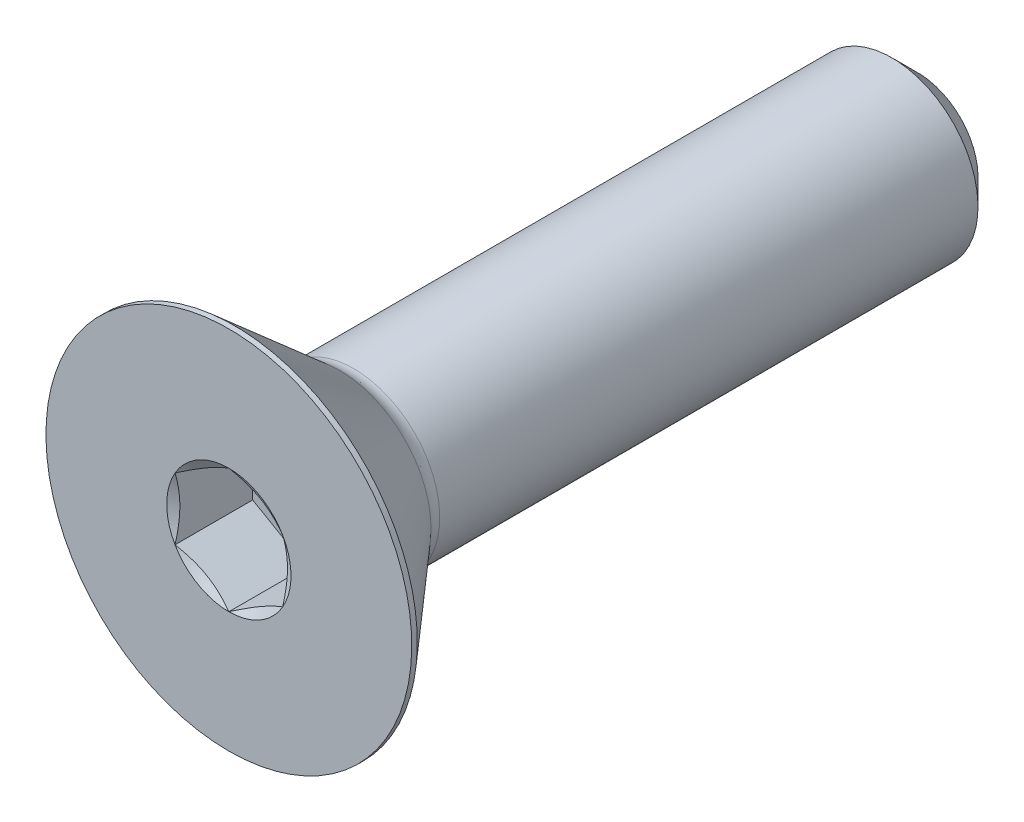
ISO-10303-21;
HEADER;
FILE_DESCRIPTION(('STEP AP214'),'2;1');
FILE_NAME('part.step','',(''),(''),'','','');
FILE_SCHEMA(('AUTOMOTIVE_DESIGN { 1 0 10303 214 1 1 1 1 }'));
ENDSEC;
DATA;
#1=APPLICATION_CONTEXT('core data for automotive mechanical design processes');
#2=APPLICATION_PROTOCOL_DEFINITION('international standard','automotive_design',2000,#1);
#3=PRODUCT_CONTEXT('',#1,'mechanical');
#4=PRODUCT('Part','Part','',(#3));
#5=PRODUCT_RELATED_PRODUCT_CATEGORY('part','',(#4));
#6=PRODUCT_DEFINITION_FORMATION('','',#4);
#7=PRODUCT_DEFINITION_CONTEXT('part definition',#1,'design');
#8=PRODUCT_DEFINITION('design','',#6,#7);
#9=PRODUCT_DEFINITION_SHAPE('','',#8);
#10=(LENGTH_UNIT() NAMED_UNIT(*) SI_UNIT(.MILLI.,.METRE.));
#11=(NAMED_UNIT(*) PLANE_ANGLE_UNIT() SI_UNIT($,.RADIAN.));
#12=(NAMED_UNIT(*) SI_UNIT($,.STERADIAN.) SOLID_ANGLE_UNIT());
#13=UNCERTAINTY_MEASURE_WITH_UNIT(LENGTH_MEASURE(1.E-05),#10,'distance_accuracy_value','');
#14=(GEOMETRIC_REPRESENTATION_CONTEXT(3) GLOBAL_UNCERTAINTY_ASSIGNED_CONTEXT((#13)) GLOBAL_UNIT_ASSIGNED_CONTEXT((#10,
#11,#12)) REPRESENTATION_CONTEXT('',''));
#15=CARTESIAN_POINT('',(0.,0.,0.));
#16=DIRECTION('',(0.,0.,1.));
#17=DIRECTION('',(1.,0.,0.));
#18=AXIS2_PLACEMENT_3D('',#15,#16,#17);
#19=CARTESIAN_POINT('',(0.,0.,-25.4));
#20=DIRECTION('',(0.,0.,-1.));
#21=DIRECTION('',(0.,1.,0.));
#22=AXIS2_PLACEMENT_3D('',#19,#20,#21);
#23=CYLINDRICAL_SURFACE('',#22,3.175);
#24=CARTESIAN_POINT('',(0.,0.,-24.4475));
#25=DIRECTION('',(0.,0.,-1.));
#26=DIRECTION('',(0.,1.,0.));
#27=AXIS2_PLACEMENT_3D('',#24,#25,#26);
#28=CIRCLE('',#27,3.175);
#29=CARTESIAN_POINT('',(0.,-3.175,-24.4475));
#30=VERTEX_POINT('',#29);
#31=EDGE_CURVE('E49',#30,#30,#28,.F.);
#32=ORIENTED_EDGE('',*,*,#31,.T.);
#33=EDGE_LOOP('',(#32));
#34=FACE_BOUND('',#33,.T.);
#35=CARTESIAN_POINT('',(0.,0.,-4.60180899712601));
#36=DIRECTION('',(0.,0.,1.));
#37=DIRECTION('',(0.,-1.,0.));
#38=AXIS2_PLACEMENT_3D('',#35,#36,#37);
#39=CIRCLE('',#38,3.175);
#40=CARTESIAN_POINT('',(0.,-3.175,-4.60180899712601));
#41=VERTEX_POINT('',#40);
#42=EDGE_CURVE('E208',#41,#41,#39,.T.);
#43=ORIENTED_EDGE('',*,*,#42,.F.);
#44=EDGE_LOOP('',(#43));
#45=FACE_BOUND('',#44,.T.);
#46=ADVANCED_FACE('F36',(#34,#45),#23,.T.);
#47=CARTESIAN_POINT('',(0.,-3.175,-25.4));
#48=DIRECTION('',(0.,0.,-1.));
#49=DIRECTION('',(0.,1.,0.));
#50=AXIS2_PLACEMENT_3D('',#47,#48,#49);
#51=PLANE('',#50);
#52=CARTESIAN_POINT('',(0.,0.,-25.4));
#53=DIRECTION('',(0.,0.,-1.));
#54=DIRECTION('',(0.,1.,0.));
#55=AXIS2_PLACEMENT_3D('',#52,#53,#54);
#56=CIRCLE('',#55,2.2225);
#57=CARTESIAN_POINT('',(0.,-2.2225,-25.4));
#58=VERTEX_POINT('',#57);
#59=EDGE_CURVE('E211',#58,#58,#56,.T.);
#60=ORIENTED_EDGE('',*,*,#59,.T.);
#61=EDGE_LOOP('',(#60));
#62=FACE_BOUND('',#61,.T.);
#63=ADVANCED_FACE('F221',(#62),#51,.T.);
#64=CARTESIAN_POINT('',(0.,0.,-25.4));
#65=DIRECTION('',(0.,0.,1.));
#66=DIRECTION('',(0.,-1.,0.));
#67=AXIS2_PLACEMENT_3D('',#64,#65,#66);
#68=CONICAL_SURFACE('',#67,2.2225,0.785398163397447);
#69=CARTESIAN_POINT('',(0.,-3.175,-24.4475));
#70=CARTESIAN_POINT('',(0.,-3.165078125,-24.457421875));
#71=CARTESIAN_POINT('',(0.,-3.15515625,-24.46734375));
#72=CARTESIAN_POINT('',(0.,-3.1353125,-24.4871875));
#73=CARTESIAN_POINT('',(0.,-3.125390625,-24.497109375));
#74=CARTESIAN_POINT('',(0.,-3.105546875,-24.516953125));
#75=CARTESIAN_POINT('',(0.,-3.095625,-24.526875));
#76=CARTESIAN_POINT('',(0.,-3.07578125,-24.54671875));
#77=CARTESIAN_POINT('',(0.,-3.065859375,-24.556640625));
#78=CARTESIAN_POINT('',(0.,-3.046015625,-24.576484375));
#79=CARTESIAN_POINT('',(0.,-3.03609375,-24.58640625));
#80=CARTESIAN_POINT('',(0.,-3.01625,-24.60625));
#81=CARTESIAN_POINT('',(0.,-3.006328125,-24.616171875));
#82=CARTESIAN_POINT('',(0.,-2.986484375,-24.636015625));
#83=CARTESIAN_POINT('',(0.,-2.9765625,-24.6459375));
#84=CARTESIAN_POINT('',(0.,-2.95671875,-24.66578125));
#85=CARTESIAN_POINT('',(0.,-2.946796875,-24.675703125));
#86=CARTESIAN_POINT('',(0.,-2.926953125,-24.695546875));
#87=CARTESIAN_POINT('',(0.,-2.91703125,-24.70546875));
#88=CARTESIAN_POINT('',(0.,-2.8971875,-24.7253125));
#89=CARTESIAN_POINT('',(0.,-2.887265625,-24.735234375));
#90=CARTESIAN_POINT('',(0.,-2.867421875,-24.755078125));
#91=CARTESIAN_POINT('',(0.,-2.8575,-24.765));
#92=CARTESIAN_POINT('',(0.,-2.83765625,-24.78484375));
#93=CARTESIAN_POINT('',(0.,-2.827734375,-24.794765625));
#94=CARTESIAN_POINT('',(0.,-2.807890625,-24.814609375));
#95=CARTESIAN_POINT('',(0.,-2.79796875,-24.82453125));
#96=CARTESIAN_POINT('',(0.,-2.778125,-24.844375));
#97=CARTESIAN_POINT('',(0.,-2.768203125,-24.854296875));
#98=CARTESIAN_POINT('',(0.,-2.748359375,-24.874140625));
#99=CARTESIAN_POINT('',(0.,-2.7384375,-24.8840625));
#100=CARTESIAN_POINT('',(0.,-2.71859375,-24.90390625));
#101=CARTESIAN_POINT('',(0.,-2.708671875,-24.913828125));
#102=CARTESIAN_POINT('',(0.,-2.688828125,-24.933671875));
#103=CARTESIAN_POINT('',(0.,-2.67890625,-24.94359375));
#104=CARTESIAN_POINT('',(0.,-2.6590625,-24.9634375));
#105=CARTESIAN_POINT('',(0.,-2.649140625,-24.973359375));
#106=CARTESIAN_POINT('',(0.,-2.629296875,-24.993203125));
#107=CARTESIAN_POINT('',(0.,-2.619375,-25.003125));
#108=CARTESIAN_POINT('',(0.,-2.59953125,-25.02296875));
#109=CARTESIAN_POINT('',(0.,-2.589609375,-25.032890625));
#110=CARTESIAN_POINT('',(0.,-2.569765625,-25.052734375));
#111=CARTESIAN_POINT('',(0.,-2.55984375,-25.06265625));
#112=CARTESIAN_POINT('',(0.,-2.54,-25.0825));
#113=CARTESIAN_POINT('',(0.,-2.530078125,-25.092421875));
#114=CARTESIAN_POINT('',(0.,-2.510234375,-25.112265625));
#115=CARTESIAN_POINT('',(0.,-2.5003125,-25.1221875));
#116=CARTESIAN_POINT('',(0.,-2.48046875,-25.14203125));
#117=CARTESIAN_POINT('',(0.,-2.470546875,-25.151953125));
#118=CARTESIAN_POINT('',(0.,-2.450703125,-25.171796875));
#119=CARTESIAN_POINT('',(0.,-2.44078125,-25.18171875));
#120=CARTESIAN_POINT('',(0.,-2.4209375,-25.2015625));
#121=CARTESIAN_POINT('',(0.,-2.411015625,-25.211484375));
#122=CARTESIAN_POINT('',(0.,-2.391171875,-25.231328125));
#123=CARTESIAN_POINT('',(0.,-2.38125,-25.24125));
#124=CARTESIAN_POINT('',(0.,-2.36140625,-25.26109375));
#125=CARTESIAN_POINT('',(0.,-2.351484375,-25.271015625));
#126=CARTESIAN_POINT('',(0.,-2.331640625,-25.290859375));
#127=CARTESIAN_POINT('',(0.,-2.32171875,-25.30078125));
#128=CARTESIAN_POINT('',(0.,-2.301875,-25.320625));
#129=CARTESIAN_POINT('',(0.,-2.291953125,-25.330546875));
#130=CARTESIAN_POINT('',(0.,-2.272109375,-25.350390625));
#131=CARTESIAN_POINT('',(0.,-2.2621875,-25.3603125));
#132=CARTESIAN_POINT('',(0.,-2.24234375,-25.38015625));
#133=CARTESIAN_POINT('',(0.,-2.232421875,-25.390078125));
#134=CARTESIAN_POINT('',(0.,-2.2225,-25.4));
#135=B_SPLINE_CURVE_WITH_KNOTS('',3,(#69,#70,#71,#72,#73,#74,#75,#76,#77,#78,#79,#80,#81,#82,
#83,#84,#85,#86,#87,#88,#89,#90,#91,#92,#93,#94,#95,#96,#97,#98,#99,#100,#101,#102,#103,#104,
#105,#106,#107,#108,#109,#110,#111,#112,#113,#114,#115,#116,#117,#118,#119,#120,#121,#122,#123,
#124,#125,#126,#127,#128,#129,#130,#131,#132,#133,#134),.UNSPECIFIED.,.F.,.F.,(4,2,2,2,2,2,2,2,
2,2,2,2,2,2,2,2,2,2,2,2,2,2,2,2,2,2,2,2,2,2,2,2,4),(0.,0.0420949505675096,0.0841899011350216,
0.126284851702534,0.168379802270046,0.210474752837558,0.252569703405068,0.29466465397258,
0.336759604540092,0.378854555107604,0.420949505675116,0.463044456242626,0.505139406810138,
0.54723435737765,0.589329307945162,0.631424258512675,0.673519209080187,0.715614159647697,
0.757709110215209,0.799804060782721,0.841899011350233,0.883993961917745,0.926088912485255,
0.968183863052767,1.01027881362028,1.05237376418779,1.0944687147553,1.13656366532281,
1.17865861589032,1.22075356645784,1.26284851702535,1.30494346759286,1.34703841816037),.UNSPECIFIED.);
#136=EDGE_CURVE('BSEAM38',#30,#58,#135,.T.);
#137=ORIENTED_EDGE('',*,*,#31,.F.);
#138=ORIENTED_EDGE('',*,*,#59,.F.);
#139=ORIENTED_EDGE('',*,*,#136,.T.);
#140=ORIENTED_EDGE('',*,*,#136,.F.);
#141=EDGE_LOOP('',(#137,#139,#138,#140));
#142=FACE_BOUND('',#141,.T.);
#143=ADVANCED_FACE('F38',(#142),#68,.T.);
#144=CARTESIAN_POINT('',(0.,0.,-4.60180899712601));
#145=DIRECTION('',(0.,0.,1.));
#146=DIRECTION('',(0.,-1.,0.));
#147=AXIS2_PLACEMENT_3D('',#144,#145,#146);
#148=TOROIDAL_SURFACE('',#147,3.95604099552516,0.781040995525161);
#149=CARTESIAN_POINT('',(0.,0.,-4.0894));
#150=DIRECTION('',(0.,0.,1.));
#151=DIRECTION('',(0.,-1.,0.));
#152=AXIS2_PLACEMENT_3D('',#149,#150,#151);
#153=CIRCLE('',#152,3.36658187365559);
#154=CARTESIAN_POINT('',(0.,-3.36658187365559,-4.0894));
#155=VERTEX_POINT('',#154);
#156=EDGE_CURVE('E205',#155,#155,#153,.T.);
#157=ORIENTED_EDGE('',*,*,#156,.F.);
#158=EDGE_LOOP('',(#157));
#159=FACE_BOUND('',#158,.T.);
#160=ORIENTED_EDGE('',*,*,#42,.T.);
#161=EDGE_LOOP('',(#160));
#162=FACE_BOUND('',#161,.T.);
#163=ADVANCED_FACE('F220',(#159,#162),#148,.F.);
#164=CARTESIAN_POINT('',(0.,0.,-4.0894));
#165=DIRECTION('',(0.,0.,1.));
#166=DIRECTION('',(0.,-1.,0.));
#167=AXIS2_PLACEMENT_3D('',#164,#165,#166);
#168=CONICAL_SURFACE('',#167,3.36658187365559,0.715584993317677);
#169=CARTESIAN_POINT('',(0.,0.,-0.204469999999999));
#170=DIRECTION('',(0.,0.,1.));
#171=DIRECTION('',(0.,-1.,0.));
#172=AXIS2_PLACEMENT_3D('',#169,#170,#171);
#173=CIRCLE('',#172,6.7437);
#174=CARTESIAN_POINT('',(0.,-6.7437,-0.204469999999999));
#175=VERTEX_POINT('',#174);
#176=EDGE_CURVE('E202',#175,#175,#173,.T.);
#177=ORIENTED_EDGE('',*,*,#176,.F.);
#178=EDGE_LOOP('',(#177));
#179=FACE_BOUND('',#178,.T.);
#180=ORIENTED_EDGE('',*,*,#156,.T.);
#181=EDGE_LOOP('',(#180));
#182=FACE_BOUND('',#181,.T.);
#183=ADVANCED_FACE('F233',(#179,#182),#168,.T.);
#184=CARTESIAN_POINT('',(0.,0.,0.));
#185=DIRECTION('',(0.,0.,1.));
#186=DIRECTION('',(0.,-1.,0.));
#187=AXIS2_PLACEMENT_3D('',#184,#185,#186);
#188=CYLINDRICAL_SURFACE('',#187,6.7437);
#189=CARTESIAN_POINT('',(0.,0.,0.));
#190=DIRECTION('',(0.,0.,1.));
#191=DIRECTION('',(0.,-1.,0.));
#192=AXIS2_PLACEMENT_3D('',#189,#190,#191);
#193=CIRCLE('',#192,6.7437);
#194=CARTESIAN_POINT('',(0.,-6.7437,0.));
#195=VERTEX_POINT('',#194);
#196=EDGE_CURVE('E190',#195,#195,#193,.T.);
#197=ORIENTED_EDGE('',*,*,#196,.F.);
#198=EDGE_LOOP('',(#197));
#199=FACE_BOUND('',#198,.T.);
#200=ORIENTED_EDGE('',*,*,#176,.T.);
#201=EDGE_LOOP('',(#200));
#202=FACE_BOUND('',#201,.T.);
#203=ADVANCED_FACE('F165',(#199,#202),#188,.T.);
#204=CARTESIAN_POINT('',(0.,-3.175,0.));
#205=DIRECTION('',(0.,0.,1.));
#206=DIRECTION('',(0.,-1.,0.));
#207=AXIS2_PLACEMENT_3D('',#204,#205,#206);
#208=PLANE('',#207);
#209=CARTESIAN_POINT('',(0.,0.,0.));
#210=DIRECTION('',(0.,0.,1.));
#211=DIRECTION('',(1.,0.,0.));
#212=AXIS2_PLACEMENT_3D('',#209,#210,#211);
#213=CIRCLE('',#212,2.29135888084633);
#214=CARTESIAN_POINT('',(0.,-2.29135888084633,0.));
#215=VERTEX_POINT('',#214);
#216=CARTESIAN_POINT('',(1.984375,-1.14567944042316,0.));
#217=VERTEX_POINT('',#216);
#218=EDGE_CURVE('E62',#215,#217,#213,.T.);
#219=ORIENTED_EDGE('',*,*,#218,.F.);
#220=CARTESIAN_POINT('',(-1.984375,-1.14567944042316,0.));
#221=VERTEX_POINT('',#220);
#222=EDGE_CURVE('E134',#221,#215,#213,.T.);
#223=ORIENTED_EDGE('',*,*,#222,.F.);
#224=CARTESIAN_POINT('',(-1.984375,1.14567944042317,0.));
#225=VERTEX_POINT('',#224);
#226=EDGE_CURVE('E133',#225,#221,#213,.T.);
#227=ORIENTED_EDGE('',*,*,#226,.F.);
#228=CARTESIAN_POINT('',(0.,2.29135888084633,0.));
#229=VERTEX_POINT('',#228);
#230=EDGE_CURVE('E103',#229,#225,#213,.T.);
#231=ORIENTED_EDGE('',*,*,#230,.F.);
#232=CARTESIAN_POINT('',(1.984375,1.14567944042316,0.));
#233=VERTEX_POINT('',#232);
#234=EDGE_CURVE('E94',#233,#229,#213,.T.);
#235=ORIENTED_EDGE('',*,*,#234,.F.);
#236=EDGE_CURVE('E55',#217,#233,#213,.T.);
#237=ORIENTED_EDGE('',*,*,#236,.F.);
#238=EDGE_LOOP('',(#219,#223,#227,#231,#235,#237));
#239=FACE_BOUND('',#238,.T.);
#240=ORIENTED_EDGE('',*,*,#196,.T.);
#241=EDGE_LOOP('',(#240));
#242=FACE_BOUND('',#241,.T.);
#243=ADVANCED_FACE('F129',(#239,#242),#208,.T.);
#244=CARTESIAN_POINT('',(0.,0.,0.));
#245=DIRECTION('',(0.,0.,1.));
#246=DIRECTION('',(1.,0.,0.));
#247=AXIS2_PLACEMENT_3D('',#244,#245,#246);
#248=CONICAL_SURFACE('',#247,2.29135888084633,1.0471975511966);
#249=ORIENTED_EDGE('',*,*,#230,.T.);
#250=CARTESIAN_POINT('',(0.000199999999999609,2.29147435090017,6.66717057831416E-05));
#251=CARTESIAN_POINT('',(-0.0870046387806768,2.24112672922556,-0.029014317759813));
#252=CARTESIAN_POINT('',(-0.174962019304997,2.19034451190263,-0.0554627919729485));
#253=CARTESIAN_POINT('',(-0.35239997867232,2.08790065829745,-0.101629728793529));
#254=CARTESIAN_POINT('',(-0.441883711256319,2.03623720120198,-0.121331857751036));
#255=CARTESIAN_POINT('',(-0.619742148012469,1.93355058486317,-0.152002268068471));
#256=CARTESIAN_POINT('',(-0.708089480306094,1.88254322878126,-0.163174657279787));
#257=CARTESIAN_POINT('',(-0.88520002811095,1.78028840632981,-0.176514203945575));
#258=CARTESIAN_POINT('',(-0.973962599510547,1.72904131183829,-0.178692405539878));
#259=CARTESIAN_POINT('',(-1.13983230286466,1.63327639395638,-0.174170448491651));
#260=CARTESIAN_POINT('',(-1.21696421566591,1.58874426333747,-0.168580586544127));
#261=CARTESIAN_POINT('',(-1.37072550718908,1.49997014028563,-0.150861066102989));
#262=CARTESIAN_POINT('',(-1.44735435374552,1.45572845509857,-0.138725349670475));
#263=CARTESIAN_POINT('',(-1.60143288850678,1.36677117157782,-0.108385841155635));
#264=CARTESIAN_POINT('',(-1.67886306721268,1.32206683705857,-0.09005339070901));
#265=CARTESIAN_POINT('',(-1.83256831124359,1.23332507304146,-0.0484454935998176));
#266=CARTESIAN_POINT('',(-1.90884534705293,1.18928650588395,-0.0251798287176209));
#267=CARTESIAN_POINT('',(-1.984575,1.14556397036933,6.66717057829762E-05));
#268=B_SPLINE_CURVE_WITH_KNOTS('',3,(#250,#251,#252,#253,#254,#255,#256,#257,#258,#259,#260,
#261,#262,#263,#264,#265,#266,#267),.UNSPECIFIED.,.F.,.F.,(4,2,2,2,2,2,2,2,4),(0.,
0.314555137114086,0.629866549668806,0.937373439505933,1.24450262309398,1.51196650590478,
1.77967834211415,2.05332989762155,2.32644383656793),.UNSPECIFIED.);
#269=EDGE_CURVE('E11',#229,#225,#268,.T.);
#270=ORIENTED_EDGE('',*,*,#269,.F.);
#271=EDGE_LOOP('',(#249,#270));
#272=FACE_BOUND('',#271,.T.);
#273=ADVANCED_FACE('F107',(#272),#248,.F.);
#274=ORIENTED_EDGE('',*,*,#226,.T.);
#275=CARTESIAN_POINT('',(-1.984375,-2.96692860034507,0.737860651092377));
#276=CARTESIAN_POINT('',(-1.984375,-2.88123645369667,0.69674880177529));
#277=CARTESIAN_POINT('',(-1.984375,-2.79533554929687,0.656063972956056));
#278=CARTESIAN_POINT('',(-1.984375,-2.62300496253372,0.575790597945192));
#279=CARTESIAN_POINT('',(-1.984375,-2.53657518838115,0.536202249047077));
#280=CARTESIAN_POINT('',(-1.984375,-2.36258003650985,0.458142914429596));
#281=CARTESIAN_POINT('',(-1.984375,-2.27501095051754,0.419680163398946));
#282=CARTESIAN_POINT('',(-1.984375,-2.09913795632987,0.344479427097519));
#283=CARTESIAN_POINT('',(-1.984375,-2.01083408662377,0.307741352146445));
#284=CARTESIAN_POINT('',(-1.984375,-1.83102497893539,0.235513729354963));
#285=CARTESIAN_POINT('',(-1.984375,-1.73949640320228,0.200081939073892));
#286=CARTESIAN_POINT('',(-1.984375,-1.55533214713673,0.132164183556778));
#287=CARTESIAN_POINT('',(-1.984375,-1.46269633980312,0.0996785599926462));
#288=CARTESIAN_POINT('',(-1.984375,-1.27638419434466,0.0385821363592113));
#289=CARTESIAN_POINT('',(-1.984375,-1.18271082678456,0.00996237523819853));
#290=CARTESIAN_POINT('',(-1.984375,-0.994021652382587,-0.0424236311394211));
#291=CARTESIAN_POINT('',(-1.984375,-0.899006185229732,-0.0661910818015453));
#292=CARTESIAN_POINT('',(-1.984375,-0.70783051245842,-0.107605260619429));
#293=CARTESIAN_POINT('',(-1.984375,-0.611673084373239,-0.125264559933971));
#294=CARTESIAN_POINT('',(-1.984375,-0.418283092113672,-0.153306903466505));
#295=CARTESIAN_POINT('',(-1.984375,-0.32105060104525,-0.163690439394072));
#296=CARTESIAN_POINT('',(-1.984375,-0.127210752774483,-0.176214799009401));
#297=CARTESIAN_POINT('',(-1.984375,-0.0306098639781231,-0.178452892631436));
#298=CARTESIAN_POINT('',(-1.984375,0.162431915887106,-0.17475795296783));
#299=CARTESIAN_POINT('',(-1.984375,0.258872796678698,-0.168824413724938));
#300=CARTESIAN_POINT('',(-1.984375,0.496826477184735,-0.144624426308478));
#301=CARTESIAN_POINT('',(-1.984375,0.637878211825128,-0.121822779785831));
#302=CARTESIAN_POINT('',(-1.984375,0.91723870370253,-0.0630239757386336));
#303=CARTESIAN_POINT('',(-1.984375,1.05554394232965,-0.0270109144574765));
#304=CARTESIAN_POINT('',(-1.984375,1.26239464896717,0.0345082078903479));
#305=CARTESIAN_POINT('',(-1.984375,1.33200934564274,0.0565514264145546));
#306=CARTESIAN_POINT('',(-1.984375,1.47051409380588,0.102676986257499));
#307=CARTESIAN_POINT('',(-1.984375,1.53940456776433,0.126758055006123));
#308=CARTESIAN_POINT('',(-1.984375,1.67655293465251,0.176609588689456));
#309=CARTESIAN_POINT('',(-1.984375,1.74481093998431,0.202379746602285));
#310=CARTESIAN_POINT('',(-1.984375,1.88078910071683,0.255330712681564));
#311=CARTESIAN_POINT('',(-1.984375,1.94850916300286,0.282511759182964));
#312=CARTESIAN_POINT('',(-1.984375,2.12136731788458,0.353633623835928));
#313=CARTESIAN_POINT('',(-1.984375,2.22615977384556,0.398413596701326));
#314=CARTESIAN_POINT('',(-1.984375,2.43479837304527,0.490132195682473));
#315=CARTESIAN_POINT('',(-1.984375,2.5386444446916,0.537070983511256));
#316=CARTESIAN_POINT('',(-1.984375,2.84907841644385,0.680364561323518));
#317=CARTESIAN_POINT('',(-1.984375,3.05452739791262,0.77918187526435));
#318=CARTESIAN_POINT('',(-1.984375,3.46367014223902,0.980960885724764));
#319=CARTESIAN_POINT('',(-1.984375,3.66736143684958,1.08392752775299));
#320=CARTESIAN_POINT('',(-1.984375,4.07334844866211,1.29250841655482));
#321=CARTESIAN_POINT('',(-1.984375,4.27564433912763,1.39812232679349));
#322=CARTESIAN_POINT('',(-1.984375,4.66022184962415,1.60111933686162));
#323=CARTESIAN_POINT('',(-1.984375,4.84259034249047,1.69833842729249));
#324=CARTESIAN_POINT('',(-1.984375,5.20674070245669,1.89388432048827));
#325=CARTESIAN_POINT('',(-1.984375,5.38852254752481,1.99221116424656));
#326=CARTESIAN_POINT('',(-1.984375,5.75117247931181,2.18944361750704));
#327=CARTESIAN_POINT('',(-1.984375,5.93204171415673,2.2883471187779));
#328=CARTESIAN_POINT('',(-1.984375,6.29341450955436,2.48679783989033));
#329=CARTESIAN_POINT('',(-1.984375,6.47391808874828,2.5863450257738));
#330=CARTESIAN_POINT('',(-1.984375,6.6542902961452,2.6861282522634));
#331=B_SPLINE_CURVE_WITH_KNOTS('',3,(#275,#276,#277,#278,#279,#280,#281,#282,#283,#284,#285,
#286,#287,#288,#289,#290,#291,#292,#293,#294,#295,#296,#297,#298,#299,#300,#301,#302,#303,#304,
#305,#306,#307,#308,#309,#310,#311,#312,#313,#314,#315,#316,#317,#318,#319,#320,#321,#322,#323,
#324,#325,#326,#327,#328,#329,#330),.UNSPECIFIED.,.F.,.F.,(4,2,2,2,2,2,2,2,2,2,2,2,2,2,2,2,2,2,
2,2,2,2,2,2,2,2,2,4),(0.,0.285135519832373,0.570322016122788,0.857238463819792,1.14413997577449,
1.43854271801315,1.7329795590899,2.02672173491208,2.32039085060263,2.61345191984504,
2.90649318156653,3.19602335108128,3.48557144803805,3.91334047285799,4.34162614021154,
4.56066589824458,4.77956986852721,4.99843415889189,5.21733554208811,5.55917796423187,
5.90104603503021,6.58489509249957,7.26958483186157,7.95418796687477,8.57417425374278,
9.1941835596094,9.81261585701217,10.431015790458),.UNSPECIFIED.);
#332=EDGE_CURVE('E102',#225,#221,#331,.F.);
#333=ORIENTED_EDGE('',*,*,#332,.F.);
#334=EDGE_LOOP('',(#274,#333));
#335=FACE_BOUND('',#334,.T.);
#336=ADVANCED_FACE('F261',(#335),#248,.F.);
#337=ORIENTED_EDGE('',*,*,#222,.T.);
#338=CARTESIAN_POINT('',(-1.984575,-1.14556397036933,6.66717057829649E-05));
#339=CARTESIAN_POINT('',(-1.89737036121932,-1.19591159204393,-0.0290143177598132));
#340=CARTESIAN_POINT('',(-1.809412980695,-1.24669380936686,-0.0554627919729487));
#341=CARTESIAN_POINT('',(-1.63197502132768,-1.34913766297205,-0.101629728793529));
#342=CARTESIAN_POINT('',(-1.54249128874368,-1.40080112006751,-0.121331857751037));
#343=CARTESIAN_POINT('',(-1.36463285198753,-1.50348773640632,-0.152002268068471));
#344=CARTESIAN_POINT('',(-1.27628551969391,-1.55449509248823,-0.163174657279787));
#345=CARTESIAN_POINT('',(-1.09917497188905,-1.65674991493968,-0.176514203945575));
#346=CARTESIAN_POINT('',(-1.01041240048945,-1.70799700943121,-0.178692405539878));
#347=CARTESIAN_POINT('',(-0.844542697135338,-1.80376192731311,-0.174170448491652));
#348=CARTESIAN_POINT('',(-0.767410784334093,-1.84829405793202,-0.168580586544128));
#349=CARTESIAN_POINT('',(-0.613649492810919,-1.93706818098387,-0.150861066102989));
#350=CARTESIAN_POINT('',(-0.537020646254476,-1.98130986617092,-0.138725349670476));
#351=CARTESIAN_POINT('',(-0.382942111493217,-2.07026714969167,-0.108385841155636));
#352=CARTESIAN_POINT('',(-0.305511932787318,-2.11497148421093,-0.0900533907090107));
#353=CARTESIAN_POINT('',(-0.151806688756412,-2.20371324822803,-0.0484454935998183));
#354=CARTESIAN_POINT('',(-0.075529652947068,-2.24775181538554,-0.0251798287176216));
#355=CARTESIAN_POINT('',(0.000199999999999772,-2.29147435090016,6.66717057822253E-05));
#356=B_SPLINE_CURVE_WITH_KNOTS('',3,(#338,#339,#340,#341,#342,#343,#344,#345,#346,#347,#348,
#349,#350,#351,#352,#353,#354,#355),.UNSPECIFIED.,.F.,.F.,(4,2,2,2,2,2,2,2,4),(0.,
0.314555137114086,0.629866549668806,0.937373439505932,1.24450262309398,1.51196650590478,
1.77967834211415,2.05332989762155,2.32644383656793),.UNSPECIFIED.);
#357=EDGE_CURVE('E142',#221,#215,#356,.T.);
#358=ORIENTED_EDGE('',*,*,#357,.F.);
#359=EDGE_LOOP('',(#337,#358));
#360=FACE_BOUND('',#359,.T.);
#361=ADVANCED_FACE('F267',(#360),#248,.F.);
#362=ORIENTED_EDGE('',*,*,#218,.T.);
#363=CARTESIAN_POINT('',(-0.000200000000000051,-2.29147435090016,6.66717057826408E-05));
#364=CARTESIAN_POINT('',(0.0870046387806763,-2.24112672922556,-0.0290143177598132));
#365=CARTESIAN_POINT('',(0.174962019304996,-2.19034451190263,-0.0554627919729487));
#366=CARTESIAN_POINT('',(0.352399978672319,-2.08790065829744,-0.101629728793529));
#367=CARTESIAN_POINT('',(0.441883711256319,-2.03623720120198,-0.121331857751037));
#368=CARTESIAN_POINT('',(0.619742148012468,-1.93355058486317,-0.152002268068471));
#369=CARTESIAN_POINT('',(0.708089480306093,-1.88254322878126,-0.163174657279787));
#370=CARTESIAN_POINT('',(0.885200028110949,-1.78028840632981,-0.176514203945575));
#371=CARTESIAN_POINT('',(0.973962599510546,-1.72904131183829,-0.178692405539878));
#372=CARTESIAN_POINT('',(1.13983230286466,-1.63327639395638,-0.174170448491652));
#373=CARTESIAN_POINT('',(1.21696421566591,-1.58874426333747,-0.168580586544128));
#374=CARTESIAN_POINT('',(1.37072550718908,-1.49997014028563,-0.150861066102989));
#375=CARTESIAN_POINT('',(1.44735435374552,-1.45572845509857,-0.138725349670476));
#376=CARTESIAN_POINT('',(1.60143288850678,-1.36677117157782,-0.108385841155636));
#377=CARTESIAN_POINT('',(1.67886306721268,-1.32206683705856,-0.0900533907090105));
#378=CARTESIAN_POINT('',(1.83256831124359,-1.23332507304146,-0.0484454935998179));
#379=CARTESIAN_POINT('',(1.90884534705293,-1.18928650588395,-0.0251798287176211));
#380=CARTESIAN_POINT('',(1.984575,-1.14556397036933,6.66717057827258E-05));
#381=B_SPLINE_CURVE_WITH_KNOTS('',3,(#363,#364,#365,#366,#367,#368,#369,#370,#371,#372,#373,
#374,#375,#376,#377,#378,#379,#380),.UNSPECIFIED.,.F.,.F.,(4,2,2,2,2,2,2,2,4),(0.,
0.314555137114085,0.629866549668806,0.937373439505932,1.24450262309398,1.51196650590478,
1.77967834211415,2.05332989762155,2.32644383656793),.UNSPECIFIED.);
#382=EDGE_CURVE('E417',#215,#217,#381,.T.);
#383=ORIENTED_EDGE('',*,*,#382,.F.);
#384=EDGE_LOOP('',(#362,#383));
#385=FACE_BOUND('',#384,.T.);
#386=ADVANCED_FACE('F274',(#385),#248,.F.);
#387=ORIENTED_EDGE('',*,*,#236,.T.);
#388=CARTESIAN_POINT('',(1.984375,-2.96692860034507,0.737860651092378));
#389=CARTESIAN_POINT('',(1.984375,-2.88123645369666,0.69674880177529));
#390=CARTESIAN_POINT('',(1.984375,-2.79533554929687,0.656063972956056));
#391=CARTESIAN_POINT('',(1.984375,-2.62300496253372,0.575790597945192));
#392=CARTESIAN_POINT('',(1.984375,-2.53657518838115,0.536202249047077));
#393=CARTESIAN_POINT('',(1.984375,-2.36258003650985,0.458142914429596));
#394=CARTESIAN_POINT('',(1.984375,-2.27501095051754,0.419680163398946));
#395=CARTESIAN_POINT('',(1.984375,-2.09913795632987,0.344479427097519));
#396=CARTESIAN_POINT('',(1.984375,-2.01083408662377,0.307741352146445));
#397=CARTESIAN_POINT('',(1.984375,-1.83102497893539,0.235513729354964));
#398=CARTESIAN_POINT('',(1.984375,-1.73949640320228,0.200081939073892));
#399=CARTESIAN_POINT('',(1.984375,-1.55533214713673,0.132164183556778));
#400=CARTESIAN_POINT('',(1.984375,-1.46269633980312,0.0996785599926464));
#401=CARTESIAN_POINT('',(1.984375,-1.27638419434466,0.0385821363592116));
#402=CARTESIAN_POINT('',(1.984375,-1.18271082678456,0.00996237523819882));
#403=CARTESIAN_POINT('',(1.984375,-0.994021652382587,-0.042423631139421));
#404=CARTESIAN_POINT('',(1.984375,-0.899006185229731,-0.0661910818015453));
#405=CARTESIAN_POINT('',(1.984375,-0.70783051245842,-0.107605260619429));
#406=CARTESIAN_POINT('',(1.984375,-0.611673084373239,-0.125264559933971));
#407=CARTESIAN_POINT('',(1.984375,-0.418283092113671,-0.153306903466505));
#408=CARTESIAN_POINT('',(1.984375,-0.32105060104525,-0.163690439394072));
#409=CARTESIAN_POINT('',(1.984375,-0.127210752774482,-0.176214799009401));
#410=CARTESIAN_POINT('',(1.984375,-0.0306098639781227,-0.178452892631436));
#411=CARTESIAN_POINT('',(1.984375,0.162431915887107,-0.17475795296783));
#412=CARTESIAN_POINT('',(1.984375,0.258872796678699,-0.168824413724938));
#413=CARTESIAN_POINT('',(1.984375,0.496826477184735,-0.144624426308478));
#414=CARTESIAN_POINT('',(1.984375,0.637878211825129,-0.12182277978583));
#415=CARTESIAN_POINT('',(1.984375,0.91723870370253,-0.0630239757386333));
#416=CARTESIAN_POINT('',(1.984375,1.05554394232965,-0.0270109144574763));
#417=CARTESIAN_POINT('',(1.984375,1.26239464896717,0.0345082078903483));
#418=CARTESIAN_POINT('',(1.984375,1.33200934564274,0.0565514264145553));
#419=CARTESIAN_POINT('',(1.984375,1.47051409380588,0.1026769862575));
#420=CARTESIAN_POINT('',(1.984375,1.53940456776433,0.126758055006124));
#421=CARTESIAN_POINT('',(1.984375,1.67655293465251,0.176609588689457));
#422=CARTESIAN_POINT('',(1.984375,1.74481093998432,0.202379746602286));
#423=CARTESIAN_POINT('',(1.984375,1.88078910071683,0.255330712681565));
#424=CARTESIAN_POINT('',(1.984375,1.94850916300287,0.282511759182965));
#425=CARTESIAN_POINT('',(1.984375,2.12136731788458,0.353633623835929));
#426=CARTESIAN_POINT('',(1.984375,2.22615977384557,0.398413596701327));
#427=CARTESIAN_POINT('',(1.984375,2.43479837304527,0.490132195682473));
#428=CARTESIAN_POINT('',(1.984375,2.5386444446916,0.537070983511257));
#429=CARTESIAN_POINT('',(1.984375,2.84907841644385,0.680364561323519));
#430=CARTESIAN_POINT('',(1.984375,3.05452739791262,0.779181875264351));
#431=CARTESIAN_POINT('',(1.984375,3.46367014223902,0.980960885724765));
#432=CARTESIAN_POINT('',(1.984375,3.66736143684958,1.08392752775299));
#433=CARTESIAN_POINT('',(1.984375,4.07334844866211,1.29250841655482));
#434=CARTESIAN_POINT('',(1.984375,4.27564433912763,1.3981223267935));
#435=CARTESIAN_POINT('',(1.984375,4.66022184962416,1.60111933686162));
#436=CARTESIAN_POINT('',(1.984375,4.84259034249048,1.6983384272925));
#437=CARTESIAN_POINT('',(1.984375,5.2067407024567,1.89388432048827));
#438=CARTESIAN_POINT('',(1.984375,5.38852254752481,1.99221116424656));
#439=CARTESIAN_POINT('',(1.984375,5.75117247931181,2.18944361750704));
#440=CARTESIAN_POINT('',(1.984375,5.93204171415673,2.2883471187779));
#441=CARTESIAN_POINT('',(1.984375,6.29341450955436,2.48679783989034));
#442=CARTESIAN_POINT('',(1.984375,6.47391808874828,2.5863450257738));
#443=CARTESIAN_POINT('',(1.984375,6.6542902961452,2.6861282522634));
#444=B_SPLINE_CURVE_WITH_KNOTS('',3,(#388,#389,#390,#391,#392,#393,#394,#395,#396,#397,#398,
#399,#400,#401,#402,#403,#404,#405,#406,#407,#408,#409,#410,#411,#412,#413,#414,#415,#416,#417,
#418,#419,#420,#421,#422,#423,#424,#425,#426,#427,#428,#429,#430,#431,#432,#433,#434,#435,#436,
#437,#438,#439,#440,#441,#442,#443),.UNSPECIFIED.,.F.,.F.,(4,2,2,2,2,2,2,2,2,2,2,2,2,2,2,2,2,2,
2,2,2,2,2,2,2,2,2,4),(0.,0.285135519832374,0.570322016122787,0.857238463819791,1.14413997577449,
1.43854271801315,1.7329795590899,2.02672173491208,2.32039085060263,2.61345191984504,
2.90649318156653,3.19602335108128,3.48557144803805,3.91334047285799,4.34162614021154,
4.56066589824458,4.77956986852721,4.9984341588919,5.21733554208812,5.55917796423187,
5.90104603503021,6.58489509249957,7.26958483186157,7.95418796687478,8.57417425374278,
9.1941835596094,9.81261585701217,10.431015790458),.UNSPECIFIED.);
#445=EDGE_CURVE('E119',#217,#233,#444,.T.);
#446=ORIENTED_EDGE('',*,*,#445,.F.);
#447=EDGE_LOOP('',(#387,#446));
#448=FACE_BOUND('',#447,.T.);
#449=ADVANCED_FACE('F281',(#448),#248,.F.);
#450=ORIENTED_EDGE('',*,*,#234,.T.);
#451=CARTESIAN_POINT('',(1.984575,1.14556397036933,6.66717057832154E-05));
#452=CARTESIAN_POINT('',(1.89737036121932,1.19591159204393,-0.029014317759813));
#453=CARTESIAN_POINT('',(1.809412980695,1.24669380936687,-0.0554627919729485));
#454=CARTESIAN_POINT('',(1.63197502132768,1.34913766297205,-0.101629728793529));
#455=CARTESIAN_POINT('',(1.54249128874368,1.40080112006751,-0.121331857751036));
#456=CARTESIAN_POINT('',(1.36463285198753,1.50348773640632,-0.152002268068471));
#457=CARTESIAN_POINT('',(1.27628551969391,1.55449509248823,-0.163174657279786));
#458=CARTESIAN_POINT('',(1.09917497188905,1.65674991493969,-0.176514203945575));
#459=CARTESIAN_POINT('',(1.01041240048945,1.70799700943121,-0.178692405539878));
#460=CARTESIAN_POINT('',(0.844542697135338,1.80376192731311,-0.174170448491651));
#461=CARTESIAN_POINT('',(0.767410784334093,1.84829405793202,-0.168580586544127));
#462=CARTESIAN_POINT('',(0.613649492810919,1.93706818098387,-0.150861066102989));
#463=CARTESIAN_POINT('',(0.537020646254476,1.98130986617092,-0.138725349670475));
#464=CARTESIAN_POINT('',(0.382942111493217,2.07026714969167,-0.108385841155635));
#465=CARTESIAN_POINT('',(0.305511932787317,2.11497148421093,-0.0900533907090102));
#466=CARTESIAN_POINT('',(0.151806688756411,2.20371324822803,-0.0484454935998178));
#467=CARTESIAN_POINT('',(0.0755296529470672,2.24775181538554,-0.0251798287176211));
#468=CARTESIAN_POINT('',(-0.000200000000000537,2.29147435090017,6.6671705782726E-05));
#469=B_SPLINE_CURVE_WITH_KNOTS('',3,(#451,#452,#453,#454,#455,#456,#457,#458,#459,#460,#461,
#462,#463,#464,#465,#466,#467,#468),.UNSPECIFIED.,.F.,.F.,(4,2,2,2,2,2,2,2,4),(0.,
0.314555137114086,0.629866549668806,0.937373439505933,1.24450262309398,1.51196650590478,
1.77967834211415,2.05332989762155,2.32644383656793),.UNSPECIFIED.);
#470=EDGE_CURVE('E98',#233,#229,#469,.T.);
#471=ORIENTED_EDGE('',*,*,#470,.F.);
#472=EDGE_LOOP('',(#450,#471));
#473=FACE_BOUND('',#472,.T.);
#474=ADVANCED_FACE('F96',(#473),#248,.F.);
#475=CARTESIAN_POINT('',(0.,2.29135888084633,-2.86258));
#476=DIRECTION('',(0.,0.,1.));
#477=DIRECTION('',(1.,0.,0.));
#478=AXIS2_PLACEMENT_3D('',#475,#476,#477);
#479=PLANE('',#478);
#480=DIRECTION('',(-0.866025403784439,0.5,0.));
#481=VECTOR('',#480,1.);
#482=CARTESIAN_POINT('',(1.984375,1.14567944042317,-2.86258));
#483=LINE('',#482,#481);
#484=CARTESIAN_POINT('',(1.984375,1.14567944042317,-2.86258));
#485=VERTEX_POINT('',#484);
#486=CARTESIAN_POINT('',(0.,2.29135888084633,-2.86258));
#487=VERTEX_POINT('',#486);
#488=EDGE_CURVE('E118',#485,#487,#483,.T.);
#489=ORIENTED_EDGE('',*,*,#488,.T.);
#490=DIRECTION('',(-0.866025403784439,-0.5,0.));
#491=VECTOR('',#490,1.);
#492=CARTESIAN_POINT('',(0.,2.29135888084633,-2.86258));
#493=LINE('',#492,#491);
#494=CARTESIAN_POINT('',(-1.984375,1.14567944042316,-2.86258));
#495=VERTEX_POINT('',#494);
#496=EDGE_CURVE('E123',#487,#495,#493,.T.);
#497=ORIENTED_EDGE('',*,*,#496,.T.);
#498=DIRECTION('',(0.,-1.,0.));
#499=VECTOR('',#498,1.);
#500=CARTESIAN_POINT('',(-1.984375,1.14567944042316,-2.86258));
#501=LINE('',#500,#499);
#502=CARTESIAN_POINT('',(-1.984375,-1.14567944042316,-2.86258));
#503=VERTEX_POINT('',#502);
#504=EDGE_CURVE('E178',#495,#503,#501,.T.);
#505=ORIENTED_EDGE('',*,*,#504,.T.);
#506=DIRECTION('',(0.866025403784439,-0.5,0.));
#507=VECTOR('',#506,1.);
#508=CARTESIAN_POINT('',(-1.984375,-1.14567944042316,-2.86258));
#509=LINE('',#508,#507);
#510=CARTESIAN_POINT('',(0.,-2.29135888084633,-2.86258));
#511=VERTEX_POINT('',#510);
#512=EDGE_CURVE('E181',#503,#511,#509,.T.);
#513=ORIENTED_EDGE('',*,*,#512,.T.);
#514=DIRECTION('',(0.866025403784439,0.5,0.));
#515=VECTOR('',#514,1.);
#516=CARTESIAN_POINT('',(0.,-2.29135888084633,-2.86258));
#517=LINE('',#516,#515);
#518=CARTESIAN_POINT('',(1.984375,-1.14567944042316,-2.86258));
#519=VERTEX_POINT('',#518);
#520=EDGE_CURVE('E184',#511,#519,#517,.T.);
#521=ORIENTED_EDGE('',*,*,#520,.T.);
#522=DIRECTION('',(0.,1.,0.));
#523=VECTOR('',#522,1.);
#524=CARTESIAN_POINT('',(1.984375,-1.14567944042316,-2.86258));
#525=LINE('',#524,#523);
#526=EDGE_CURVE('E126',#519,#485,#525,.T.);
#527=ORIENTED_EDGE('',*,*,#526,.T.);
#528=EDGE_LOOP('',(#489,#497,#505,#513,#521,#527));
#529=FACE_BOUND('',#528,.T.);
#530=ADVANCED_FACE('F160',(#529),#479,.T.);
#531=CARTESIAN_POINT('',(0.,2.29135888084633,-2.86258));
#532=DIRECTION('',(-0.5,0.866025403784439,0.));
#533=DIRECTION('',(-0.866025403784439,-0.5,0.));
#534=AXIS2_PLACEMENT_3D('',#531,#532,#533);
#535=PLANE('',#534);
#536=DIRECTION('',(0.,0.,1.));
#537=VECTOR('',#536,1.);
#538=CARTESIAN_POINT('',(0.,2.29135888084633,-2.86258));
#539=LINE('',#538,#537);
#540=EDGE_CURVE('E115',#487,#229,#539,.T.);
#541=ORIENTED_EDGE('',*,*,#540,.T.);
#542=ORIENTED_EDGE('',*,*,#269,.T.);
#543=DIRECTION('',(0.,0.,1.));
#544=VECTOR('',#543,1.);
#545=CARTESIAN_POINT('',(-1.984375,1.14567944042316,-2.86258));
#546=LINE('',#545,#544);
#547=EDGE_CURVE('E125',#495,#225,#546,.T.);
#548=ORIENTED_EDGE('',*,*,#547,.F.);
#549=ORIENTED_EDGE('',*,*,#496,.F.);
#550=EDGE_LOOP('',(#541,#542,#548,#549));
#551=FACE_BOUND('',#550,.T.);
#552=ADVANCED_FACE('F121',(#551),#535,.F.);
#553=CARTESIAN_POINT('',(-1.984375,1.14567944042316,-2.86258));
#554=DIRECTION('',(-1.,0.,0.));
#555=DIRECTION('',(0.,-1.,0.));
#556=AXIS2_PLACEMENT_3D('',#553,#554,#555);
#557=PLANE('',#556);
#558=ORIENTED_EDGE('',*,*,#547,.T.);
#559=ORIENTED_EDGE('',*,*,#332,.T.);
#560=DIRECTION('',(0.,0.,1.));
#561=VECTOR('',#560,1.);
#562=CARTESIAN_POINT('',(-1.984375,-1.14567944042316,-2.86258));
#563=LINE('',#562,#561);
#564=EDGE_CURVE('E197',#503,#221,#563,.T.);
#565=ORIENTED_EDGE('',*,*,#564,.F.);
#566=ORIENTED_EDGE('',*,*,#504,.F.);
#567=EDGE_LOOP('',(#558,#559,#565,#566));
#568=FACE_BOUND('',#567,.T.);
#569=ADVANCED_FACE('F150',(#568),#557,.F.);
#570=CARTESIAN_POINT('',(-1.984375,-1.14567944042316,-2.86258));
#571=DIRECTION('',(-0.5,-0.866025403784439,0.));
#572=DIRECTION('',(0.866025403784439,-0.5,0.));
#573=AXIS2_PLACEMENT_3D('',#570,#571,#572);
#574=PLANE('',#573);
#575=ORIENTED_EDGE('',*,*,#564,.T.);
#576=ORIENTED_EDGE('',*,*,#357,.T.);
#577=DIRECTION('',(0.,0.,1.));
#578=VECTOR('',#577,1.);
#579=CARTESIAN_POINT('',(0.,-2.29135888084633,-2.86258));
#580=LINE('',#579,#578);
#581=EDGE_CURVE('E194',#511,#215,#580,.T.);
#582=ORIENTED_EDGE('',*,*,#581,.F.);
#583=ORIENTED_EDGE('',*,*,#512,.F.);
#584=EDGE_LOOP('',(#575,#576,#582,#583));
#585=FACE_BOUND('',#584,.T.);
#586=ADVANCED_FACE('F153',(#585),#574,.F.);
#587=CARTESIAN_POINT('',(0.,-2.29135888084633,-2.86258));
#588=DIRECTION('',(0.5,-0.866025403784439,0.));
#589=DIRECTION('',(0.866025403784439,0.5,0.));
#590=AXIS2_PLACEMENT_3D('',#587,#588,#589);
#591=PLANE('',#590);
#592=ORIENTED_EDGE('',*,*,#581,.T.);
#593=ORIENTED_EDGE('',*,*,#382,.T.);
#594=DIRECTION('',(0.,0.,1.));
#595=VECTOR('',#594,1.);
#596=CARTESIAN_POINT('',(1.984375,-1.14567944042316,-2.86258));
#597=LINE('',#596,#595);
#598=EDGE_CURVE('E191',#519,#217,#597,.T.);
#599=ORIENTED_EDGE('',*,*,#598,.F.);
#600=ORIENTED_EDGE('',*,*,#520,.F.);
#601=EDGE_LOOP('',(#592,#593,#599,#600));
#602=FACE_BOUND('',#601,.T.);
#603=ADVANCED_FACE('F310',(#602),#591,.F.);
#604=CARTESIAN_POINT('',(1.984375,-1.14567944042316,-2.86258));
#605=DIRECTION('',(1.,0.,0.));
#606=DIRECTION('',(0.,0.,-1.));
#607=AXIS2_PLACEMENT_3D('',#604,#605,#606);
#608=PLANE('',#607);
#609=ORIENTED_EDGE('',*,*,#598,.T.);
#610=ORIENTED_EDGE('',*,*,#445,.T.);
#611=DIRECTION('',(0.,0.,1.));
#612=VECTOR('',#611,1.);
#613=CARTESIAN_POINT('',(1.984375,1.14567944042317,-2.86258));
#614=LINE('',#613,#612);
#615=EDGE_CURVE('E117',#485,#233,#614,.T.);
#616=ORIENTED_EDGE('',*,*,#615,.F.);
#617=ORIENTED_EDGE('',*,*,#526,.F.);
#618=EDGE_LOOP('',(#609,#610,#616,#617));
#619=FACE_BOUND('',#618,.T.);
#620=ADVANCED_FACE('F164',(#619),#608,.F.);
#621=CARTESIAN_POINT('',(1.984375,1.14567944042317,-2.86258));
#622=DIRECTION('',(0.5,0.866025403784439,0.));
#623=DIRECTION('',(-0.866025403784439,0.5,0.));
#624=AXIS2_PLACEMENT_3D('',#621,#622,#623);
#625=PLANE('',#624);
#626=ORIENTED_EDGE('',*,*,#615,.T.);
#627=ORIENTED_EDGE('',*,*,#470,.T.);
#628=ORIENTED_EDGE('',*,*,#540,.F.);
#629=ORIENTED_EDGE('',*,*,#488,.F.);
#630=EDGE_LOOP('',(#626,#627,#628,#629));
#631=FACE_BOUND('',#630,.T.);
#632=ADVANCED_FACE('F113',(#631),#625,.F.);
#633=CLOSED_SHELL('',(#46,#63,#143,#163,#183,#203,#243,#273,#336,#361,#386,#449,#474,#530,#552,
#569,#586,#603,#620,#632));
#634=MANIFOLD_SOLID_BREP('B2',#633);
#635=ADVANCED_BREP_SHAPE_REPRESENTATION('',(#18,#634),#14);
#636=SHAPE_DEFINITION_REPRESENTATION(#9,#635);
ENDSEC;
END-ISO-10303-21;
